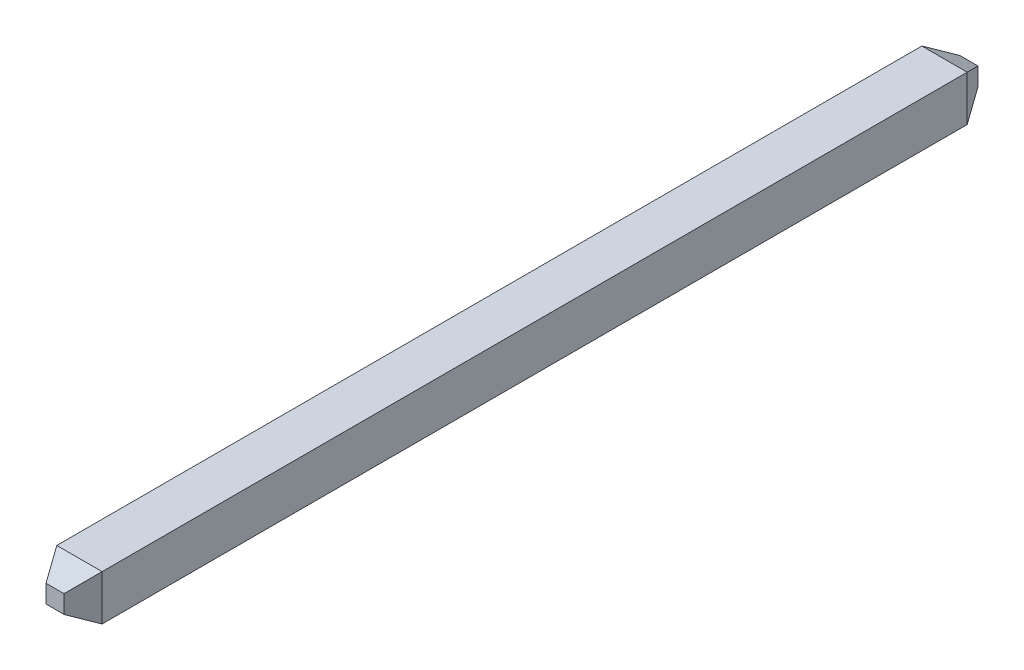
ISO-10303-21;
HEADER;
FILE_DESCRIPTION(('STEP AP214'),'2;1');
FILE_NAME('part.step','',(''),(''),'','','');
FILE_SCHEMA(('AUTOMOTIVE_DESIGN { 1 0 10303 214 1 1 1 1 }'));
ENDSEC;
DATA;
#1=APPLICATION_CONTEXT('core data for automotive mechanical design processes');
#2=APPLICATION_PROTOCOL_DEFINITION('international standard','automotive_design',2000,#1);
#3=PRODUCT_CONTEXT('',#1,'mechanical');
#4=PRODUCT('Part','Part','',(#3));
#5=PRODUCT_RELATED_PRODUCT_CATEGORY('part','',(#4));
#6=PRODUCT_DEFINITION_FORMATION('','',#4);
#7=PRODUCT_DEFINITION_CONTEXT('part definition',#1,'design');
#8=PRODUCT_DEFINITION('design','',#6,#7);
#9=PRODUCT_DEFINITION_SHAPE('','',#8);
#10=(LENGTH_UNIT() NAMED_UNIT(*) SI_UNIT(.MILLI.,.METRE.));
#11=(NAMED_UNIT(*) PLANE_ANGLE_UNIT() SI_UNIT($,.RADIAN.));
#12=(NAMED_UNIT(*) SI_UNIT($,.STERADIAN.) SOLID_ANGLE_UNIT());
#13=UNCERTAINTY_MEASURE_WITH_UNIT(LENGTH_MEASURE(1.E-05),#10,'distance_accuracy_value','');
#14=(GEOMETRIC_REPRESENTATION_CONTEXT(3) GLOBAL_UNCERTAINTY_ASSIGNED_CONTEXT((#13)) GLOBAL_UNIT_ASSIGNED_CONTEXT((#10,
#11,#12)) REPRESENTATION_CONTEXT('',''));
#15=CARTESIAN_POINT('',(0.,0.,0.));
#16=DIRECTION('',(0.,0.,1.));
#17=DIRECTION('',(1.,0.,0.));
#18=AXIS2_PLACEMENT_3D('',#15,#16,#17);
#19=CARTESIAN_POINT('',(0.120115100419239,-1.595,-3.20872569516347));
#20=DIRECTION('',(0.872569516347454,0.,-0.488489958076081));
#21=DIRECTION('',(-0.488489958076081,0.,-0.872569516347454));
#22=AXIS2_PLACEMENT_3D('',#19,#20,#21);
#23=PLANE('',#22);
#24=DIRECTION('',(0.,1.,0.));
#25=VECTOR('',#24,1.);
#26=CARTESIAN_POINT('',(0.315341856644683,-1.595,-2.86000017186176));
#27=LINE('',#26,#25);
#28=CARTESIAN_POINT('',(0.315341856632625,-1.58500002468493,-2.85999984563027));
#29=VERTEX_POINT('',#28);
#30=CARTESIAN_POINT('',(0.315342017291865,-0.954999839641339,-2.8599998849043));
#31=VERTEX_POINT('',#30);
#32=EDGE_CURVE('E118',#29,#31,#27,.T.);
#33=ORIENTED_EDGE('',*,*,#32,.F.);
#34=DIRECTION('',(0.439072617568639,-0.438284036988113,0.784297353956282));
#35=VECTOR('',#34,1.);
#36=CARTESIAN_POINT('',(0.125000000000004,-1.395,-3.2));
#37=LINE('',#36,#35);
#38=CARTESIAN_POINT('',(0.125000000000003,-1.395,-3.2));
#39=VERTEX_POINT('',#38);
#40=EDGE_CURVE('E116',#39,#29,#37,.T.);
#41=ORIENTED_EDGE('',*,*,#40,.F.);
#42=DIRECTION('',(0.,1.,0.));
#43=VECTOR('',#42,1.);
#44=CARTESIAN_POINT('',(0.125000000000004,-1.405,-3.2));
#45=LINE('',#44,#43);
#46=CARTESIAN_POINT('',(0.125000000000003,-1.145,-3.2));
#47=VERTEX_POINT('',#46);
#48=EDGE_CURVE('E79',#47,#39,#45,.F.);
#49=ORIENTED_EDGE('',*,*,#48,.F.);
#50=DIRECTION('',(-0.439072617568639,-0.438284036988113,-0.784297353956283));
#51=VECTOR('',#50,1.);
#52=CARTESIAN_POINT('',(0.315341856644679,-0.955000000000001,-2.86000017186176));
#53=LINE('',#52,#51);
#54=EDGE_CURVE('E110',#31,#47,#53,.T.);
#55=ORIENTED_EDGE('',*,*,#54,.F.);
#56=EDGE_LOOP('',(#33,#41,#49,#55));
#57=FACE_BOUND('',#56,.T.);
#58=ADVANCED_FACE('F17',(#57),#23,.T.);
#59=CARTESIAN_POINT('',(0.12036702814295,-1.595,9.50441734607014));
#60=DIRECTION('',(0.873317045523297,0.,0.487152273933377));
#61=DIRECTION('',(0.487152273933377,0.,-0.873317045523297));
#62=AXIS2_PLACEMENT_3D('',#59,#60,#61);
#63=PLANE('',#62);
#64=DIRECTION('',(-0.437799852400895,0.438586917260846,0.784839349959839));
#65=VECTOR('',#64,1.);
#66=CARTESIAN_POINT('',(0.314897899551643,-1.58500031317147,9.15568378706484));
#67=LINE('',#66,#65);
#68=CARTESIAN_POINT('',(0.314897654549926,-1.58500010892315,9.15568368845102));
#69=VERTEX_POINT('',#68);
#70=CARTESIAN_POINT('',(0.125238550882283,-1.395,9.49568417561491));
#71=VERTEX_POINT('',#70);
#72=EDGE_CURVE('E122',#69,#71,#67,.T.);
#73=ORIENTED_EDGE('',*,*,#72,.F.);
#74=DIRECTION('',(0.,1.,0.));
#75=VECTOR('',#74,1.);
#76=CARTESIAN_POINT('',(0.314898539006426,-1.595,9.15568372243698));
#77=LINE('',#76,#75);
#78=CARTESIAN_POINT('',(0.31489765280461,-0.9549998229674,9.15568371270385));
#79=VERTEX_POINT('',#78);
#80=EDGE_CURVE('E89',#79,#69,#77,.F.);
#81=ORIENTED_EDGE('',*,*,#80,.F.);
#82=DIRECTION('',(0.437799852400897,0.438586917260845,-0.784839349959838));
#83=VECTOR('',#82,1.);
#84=CARTESIAN_POINT('',(0.125238550882283,-1.145,9.49568417561491));
#85=LINE('',#84,#83);
#86=CARTESIAN_POINT('',(0.125238550882283,-1.145,9.49568417561491));
#87=VERTEX_POINT('',#86);
#88=EDGE_CURVE('E84',#87,#79,#85,.T.);
#89=ORIENTED_EDGE('',*,*,#88,.F.);
#90=DIRECTION('',(0.,1.,0.));
#91=VECTOR('',#90,1.);
#92=CARTESIAN_POINT('',(0.125238550882283,-1.135,9.49568417561491));
#93=LINE('',#92,#91);
#94=EDGE_CURVE('E20',#71,#87,#93,.T.);
#95=ORIENTED_EDGE('',*,*,#94,.F.);
#96=EDGE_LOOP('',(#73,#81,#89,#95));
#97=FACE_BOUND('',#96,.T.);
#98=ADVANCED_FACE('F86',(#97),#63,.T.);
#99=CARTESIAN_POINT('',(-0.134761449117717,-1.135,9.49568417561491));
#100=DIRECTION('',(0.,0.,1.));
#101=DIRECTION('',(1.,0.,0.));
#102=AXIS2_PLACEMENT_3D('',#99,#100,#101);
#103=PLANE('',#102);
#104=DIRECTION('',(1.,0.,0.));
#105=VECTOR('',#104,1.);
#106=CARTESIAN_POINT('',(-0.325103305762397,-1.145,9.49568417561491));
#107=LINE('',#106,#105);
#108=CARTESIAN_POINT('',(-0.124761449117718,-1.145,9.49568417561491));
#109=VERTEX_POINT('',#108);
#110=EDGE_CURVE('E93',#109,#87,#107,.T.);
#111=ORIENTED_EDGE('',*,*,#110,.F.);
#112=DIRECTION('',(0.,1.,0.));
#113=VECTOR('',#112,1.);
#114=CARTESIAN_POINT('',(-0.124761449117719,-1.595,9.49568417561491));
#115=LINE('',#114,#113);
#116=CARTESIAN_POINT('',(-0.124761449117718,-1.395,9.49568417561491));
#117=VERTEX_POINT('',#116);
#118=EDGE_CURVE('E129',#117,#109,#115,.T.);
#119=ORIENTED_EDGE('',*,*,#118,.F.);
#120=DIRECTION('',(1.,0.,0.));
#121=VECTOR('',#120,1.);
#122=CARTESIAN_POINT('',(-0.325103305762399,-1.395,9.49568417561491));
#123=LINE('',#122,#121);
#124=EDGE_CURVE('E98',#71,#117,#123,.F.);
#125=ORIENTED_EDGE('',*,*,#124,.F.);
#126=ORIENTED_EDGE('',*,*,#94,.T.);
#127=EDGE_LOOP('',(#111,#119,#125,#126));
#128=FACE_BOUND('',#127,.T.);
#129=ADVANCED_FACE('F95',(#128),#103,.T.);
#130=CARTESIAN_POINT('',(-0.325103305762397,-1.14987821545568,9.50441360938624));
#131=DIRECTION('',(0.,0.872943377132664,0.487821545567864));
#132=DIRECTION('',(0.,-0.487821545567864,0.872943377132664));
#133=AXIS2_PLACEMENT_3D('',#130,#131,#132);
#134=PLANE('',#133);
#135=DIRECTION('',(-0.439072459537934,0.438284700441648,-0.784297071672517));
#136=VECTOR('',#135,1.);
#137=CARTESIAN_POINT('',(-0.124761449117719,-1.145,9.49568417561491));
#138=LINE('',#137,#136);
#139=CARTESIAN_POINT('',(-0.315102496297201,-0.954999917527425,9.15568447138296));
#140=VERTEX_POINT('',#139);
#141=EDGE_CURVE('E102',#109,#140,#138,.T.);
#142=ORIENTED_EDGE('',*,*,#141,.F.);
#143=ORIENTED_EDGE('',*,*,#110,.T.);
#144=ORIENTED_EDGE('',*,*,#88,.T.);
#145=DIRECTION('',(1.,0.,0.));
#146=VECTOR('',#145,1.);
#147=CARTESIAN_POINT('',(6.65893728155065E-05,-0.955,9.15568497320463));
#148=LINE('',#147,#146);
#149=EDGE_CURVE('E131',#140,#79,#148,.T.);
#150=ORIENTED_EDGE('',*,*,#149,.F.);
#151=EDGE_LOOP('',(#142,#143,#144,#150));
#152=FACE_BOUND('',#151,.T.);
#153=ADVANCED_FACE('F100',(#152),#134,.T.);
#154=CARTESIAN_POINT('',(-0.135,-1.405,-3.2));
#155=DIRECTION('',(0.,0.,-1.));
#156=DIRECTION('',(-1.,0.,0.));
#157=AXIS2_PLACEMENT_3D('',#154,#155,#156);
#158=PLANE('',#157);
#159=ORIENTED_EDGE('',*,*,#48,.T.);
#160=DIRECTION('',(1.,0.,0.));
#161=VECTOR('',#160,1.);
#162=CARTESIAN_POINT('',(-0.324658143355321,-1.395,-3.2));
#163=LINE('',#162,#161);
#164=CARTESIAN_POINT('',(-0.124999999999996,-1.395,-3.2));
#165=VERTEX_POINT('',#164);
#166=EDGE_CURVE('E113',#165,#39,#163,.T.);
#167=ORIENTED_EDGE('',*,*,#166,.F.);
#168=DIRECTION('',(0.,1.,0.));
#169=VECTOR('',#168,1.);
#170=CARTESIAN_POINT('',(-0.124999999999998,-1.595,-3.2));
#171=LINE('',#170,#169);
#172=CARTESIAN_POINT('',(-0.124999999999996,-1.145,-3.2));
#173=VERTEX_POINT('',#172);
#174=EDGE_CURVE('E140',#173,#165,#171,.F.);
#175=ORIENTED_EDGE('',*,*,#174,.F.);
#176=DIRECTION('',(1.,0.,0.));
#177=VECTOR('',#176,1.);
#178=CARTESIAN_POINT('',(-0.32465814335532,-1.145,-3.2));
#179=LINE('',#178,#177);
#180=EDGE_CURVE('E105',#47,#173,#179,.F.);
#181=ORIENTED_EDGE('',*,*,#180,.F.);
#182=EDGE_LOOP('',(#159,#167,#175,#181));
#183=FACE_BOUND('',#182,.T.);
#184=ADVANCED_FACE('F184',(#183),#158,.T.);
#185=CARTESIAN_POINT('',(-0.32465814335532,-0.950121784544321,-2.85127073809043));
#186=DIRECTION('',(0.,0.872943377132663,-0.487821545567865));
#187=DIRECTION('',(0.,0.487821545567865,0.872943377132663));
#188=AXIS2_PLACEMENT_3D('',#185,#186,#187);
#189=PLANE('',#188);
#190=DIRECTION('',(1.,0.,0.));
#191=VECTOR('',#190,1.);
#192=CARTESIAN_POINT('',(6.65893728155065E-05,-0.955,-2.86000017186176));
#193=LINE('',#192,#191);
#194=CARTESIAN_POINT('',(-0.314658552313813,-0.954999293190895,-2.8599984305592));
#195=VERTEX_POINT('',#194);
#196=EDGE_CURVE('E137',#31,#195,#193,.F.);
#197=ORIENTED_EDGE('',*,*,#196,.F.);
#198=ORIENTED_EDGE('',*,*,#54,.T.);
#199=ORIENTED_EDGE('',*,*,#180,.T.);
#200=DIRECTION('',(0.437798396819593,-0.438586429089662,-0.784840434713052));
#201=VECTOR('',#200,1.);
#202=CARTESIAN_POINT('',(-0.314659335924682,-0.954999279369218,-2.85999803394471));
#203=LINE('',#202,#201);
#204=EDGE_CURVE('E145',#195,#173,#203,.T.);
#205=ORIENTED_EDGE('',*,*,#204,.F.);
#206=EDGE_LOOP('',(#197,#198,#199,#205));
#207=FACE_BOUND('',#206,.T.);
#208=ADVANCED_FACE('F182',(#207),#189,.T.);
#209=CARTESIAN_POINT('',(-0.324658143355321,-1.39012178454432,-3.20872943377133));
#210=DIRECTION('',(0.,-0.872943377132663,-0.487821545567865));
#211=DIRECTION('',(0.,0.487821545567865,-0.872943377132663));
#212=AXIS2_PLACEMENT_3D('',#209,#210,#211);
#213=PLANE('',#212);
#214=ORIENTED_EDGE('',*,*,#166,.T.);
#215=ORIENTED_EDGE('',*,*,#40,.T.);
#216=DIRECTION('',(1.,0.,0.));
#217=VECTOR('',#216,1.);
#218=CARTESIAN_POINT('',(-0.325051653144535,-1.585,-2.85999756200982));
#219=LINE('',#218,#217);
#220=CARTESIAN_POINT('',(-0.314658017815116,-1.58500027023654,-2.85999898491791));
#221=VERTEX_POINT('',#220);
#222=EDGE_CURVE('E35',#221,#29,#219,.T.);
#223=ORIENTED_EDGE('',*,*,#222,.F.);
#224=DIRECTION('',(-0.437798396819594,-0.438586429089659,0.784840434713054));
#225=VECTOR('',#224,1.);
#226=CARTESIAN_POINT('',(-0.124999999999998,-1.395,-3.2));
#227=LINE('',#226,#225);
#228=EDGE_CURVE('E143',#165,#221,#227,.T.);
#229=ORIENTED_EDGE('',*,*,#228,.F.);
#230=EDGE_LOOP('',(#214,#215,#223,#229));
#231=FACE_BOUND('',#230,.T.);
#232=ADVANCED_FACE('F185',(#231),#213,.T.);
#233=CARTESIAN_POINT('',(0.315346308268754,-1.595,-2.98065701705514));
#234=DIRECTION('',(0.999999999319383,0.,3.68949151671738E-05));
#235=DIRECTION('',(3.68949151671738E-05,0.,-0.999999999319383));
#236=AXIS2_PLACEMENT_3D('',#233,#234,#235);
#237=PLANE('',#236);
#238=DIRECTION('',(3.69481335093583E-05,0.,-0.999999999317418));
#239=VECTOR('',#238,1.);
#240=CARTESIAN_POINT('',(0.314897899551644,-0.955,9.15568372241339));
#241=LINE('',#240,#239);
#242=EDGE_CURVE('E134',#79,#31,#241,.T.);
#243=ORIENTED_EDGE('',*,*,#242,.F.);
#244=ORIENTED_EDGE('',*,*,#80,.T.);
#245=DIRECTION('',(-3.69481335094485E-05,0.,0.999999999317418));
#246=VECTOR('',#245,1.);
#247=CARTESIAN_POINT('',(0.315341856644679,-1.585,-2.86000017186176));
#248=LINE('',#247,#246);
#249=EDGE_CURVE('E149',#29,#69,#248,.T.);
#250=ORIENTED_EDGE('',*,*,#249,.F.);
#251=ORIENTED_EDGE('',*,*,#32,.T.);
#252=EDGE_LOOP('',(#243,#244,#250,#251));
#253=FACE_BOUND('',#252,.T.);
#254=ADVANCED_FACE('F187',(#253),#237,.T.);
#255=CARTESIAN_POINT('',(-0.325103305762399,-1.58987821545568,9.14695491370534));
#256=DIRECTION('',(0.,-0.872943377132664,0.487821545567864));
#257=DIRECTION('',(0.,-0.487821545567864,-0.872943377132664));
#258=AXIS2_PLACEMENT_3D('',#255,#256,#257);
#259=PLANE('',#258);
#260=ORIENTED_EDGE('',*,*,#124,.T.);
#261=DIRECTION('',(0.439072459537934,0.438284700441648,0.784297071672516));
#262=VECTOR('',#261,1.);
#263=CARTESIAN_POINT('',(-0.315102751134454,-1.5849998023649,9.15568533818575));
#264=LINE('',#263,#262);
#265=CARTESIAN_POINT('',(-0.315102182397624,-1.58499988392429,9.15568487573228));
#266=VERTEX_POINT('',#265);
#267=EDGE_CURVE('E126',#266,#117,#264,.T.);
#268=ORIENTED_EDGE('',*,*,#267,.F.);
#269=DIRECTION('',(1.,0.,0.));
#270=VECTOR('',#269,1.);
#271=CARTESIAN_POINT('',(-0.325051653144535,-1.585,9.15568372241339));
#272=LINE('',#271,#270);
#273=EDGE_CURVE('E152',#69,#266,#272,.F.);
#274=ORIENTED_EDGE('',*,*,#273,.F.);
#275=ORIENTED_EDGE('',*,*,#72,.T.);
#276=EDGE_LOOP('',(#260,#268,#274,#275));
#277=FACE_BOUND('',#276,.T.);
#278=ADVANCED_FACE('F174',(#277),#259,.T.);
#279=CARTESIAN_POINT('',(-0.119876549536956,-1.595,9.50440987077839));
#280=DIRECTION('',(-0.872569516347453,0.,0.488489958076082));
#281=DIRECTION('',(0.488489958076082,0.,0.872569516347453));
#282=AXIS2_PLACEMENT_3D('',#279,#280,#281);
#283=PLANE('',#282);
#284=ORIENTED_EDGE('',*,*,#267,.T.);
#285=ORIENTED_EDGE('',*,*,#118,.T.);
#286=ORIENTED_EDGE('',*,*,#141,.T.);
#287=DIRECTION('',(0.,1.,0.));
#288=VECTOR('',#287,1.);
#289=CARTESIAN_POINT('',(-0.315101461039725,-1.595,9.15568497322818));
#290=LINE('',#289,#288);
#291=EDGE_CURVE('E155',#266,#140,#290,.T.);
#292=ORIENTED_EDGE('',*,*,#291,.F.);
#293=EDGE_LOOP('',(#284,#285,#286,#292));
#294=FACE_BOUND('',#293,.T.);
#295=ADVANCED_FACE('F177',(#294),#283,.T.);
#296=CARTESIAN_POINT('',(6.65893728155065E-05,-0.955,9.32634470275115));
#297=DIRECTION('',(0.,1.,0.));
#298=DIRECTION('',(0.,0.,1.));
#299=AXIS2_PLACEMENT_3D('',#296,#297,#298);
#300=PLANE('',#299);
#301=ORIENTED_EDGE('',*,*,#196,.T.);
#302=DIRECTION('',(-3.68949151674615E-05,0.,0.999999999319383));
#303=VECTOR('',#302,1.);
#304=CARTESIAN_POINT('',(-0.31510775764562,-0.955000197635096,9.32634821671993));
#305=LINE('',#304,#303);
#306=EDGE_CURVE('E158',#140,#195,#305,.F.);
#307=ORIENTED_EDGE('',*,*,#306,.F.);
#308=ORIENTED_EDGE('',*,*,#149,.T.);
#309=ORIENTED_EDGE('',*,*,#242,.T.);
#310=EDGE_LOOP('',(#301,#307,#308,#309));
#311=FACE_BOUND('',#310,.T.);
#312=ADVANCED_FACE('F179',(#311),#300,.T.);
#313=CARTESIAN_POINT('',(-0.120128477260666,-1.595,-3.20873317045523));
#314=DIRECTION('',(-0.873317045523297,0.,-0.487152273933376));
#315=DIRECTION('',(-0.487152273933376,0.,0.873317045523297));
#316=AXIS2_PLACEMENT_3D('',#313,#314,#315);
#317=PLANE('',#316);
#318=DIRECTION('',(0.,1.,0.));
#319=VECTOR('',#318,1.);
#320=CARTESIAN_POINT('',(-0.314658143451607,-1.595,-2.85999756199704));
#321=LINE('',#320,#319);
#322=EDGE_CURVE('E26',#195,#221,#321,.F.);
#323=ORIENTED_EDGE('',*,*,#322,.F.);
#324=ORIENTED_EDGE('',*,*,#204,.T.);
#325=ORIENTED_EDGE('',*,*,#174,.T.);
#326=ORIENTED_EDGE('',*,*,#228,.T.);
#327=EDGE_LOOP('',(#323,#324,#325,#326));
#328=FACE_BOUND('',#327,.T.);
#329=ADVANCED_FACE('F168',(#328),#317,.T.);
#330=CARTESIAN_POINT('',(-0.325051653144535,-1.585,3.17284922525592));
#331=DIRECTION('',(0.,-1.,0.));
#332=DIRECTION('',(0.,0.,-1.));
#333=AXIS2_PLACEMENT_3D('',#330,#331,#332);
#334=PLANE('',#333);
#335=ORIENTED_EDGE('',*,*,#249,.T.);
#336=ORIENTED_EDGE('',*,*,#273,.T.);
#337=DIRECTION('',(-3.68949151674615E-05,0.,0.999999999319383));
#338=VECTOR('',#337,1.);
#339=CARTESIAN_POINT('',(-0.31510775764562,-1.58500072063078,9.32634821671993));
#340=LINE('',#339,#338);
#341=EDGE_CURVE('E11',#221,#266,#340,.T.);
#342=ORIENTED_EDGE('',*,*,#341,.F.);
#343=ORIENTED_EDGE('',*,*,#222,.T.);
#344=EDGE_LOOP('',(#335,#336,#342,#343));
#345=FACE_BOUND('',#344,.T.);
#346=ADVANCED_FACE('F170',(#345),#334,.T.);
#347=CARTESIAN_POINT('',(-0.31510775764562,-1.595,9.32634821671993));
#348=DIRECTION('',(-0.999999999319383,0.,-3.68949151674615E-05));
#349=DIRECTION('',(-3.68949151674615E-05,0.,0.999999999319383));
#350=AXIS2_PLACEMENT_3D('',#347,#348,#349);
#351=PLANE('',#350);
#352=ORIENTED_EDGE('',*,*,#322,.T.);
#353=ORIENTED_EDGE('',*,*,#341,.T.);
#354=ORIENTED_EDGE('',*,*,#291,.T.);
#355=ORIENTED_EDGE('',*,*,#306,.T.);
#356=EDGE_LOOP('',(#352,#353,#354,#355));
#357=FACE_BOUND('',#356,.T.);
#358=ADVANCED_FACE('F164',(#357),#351,.T.);
#359=CLOSED_SHELL('',(#58,#98,#129,#153,#184,#208,#232,#254,#278,#295,#312,#329,#346,#358));
#360=MANIFOLD_SOLID_BREP('B1',#359);
#361=ADVANCED_BREP_SHAPE_REPRESENTATION('',(#18,#360),#14);
#362=SHAPE_DEFINITION_REPRESENTATION(#9,#361);
ENDSEC;
END-ISO-10303-21;
